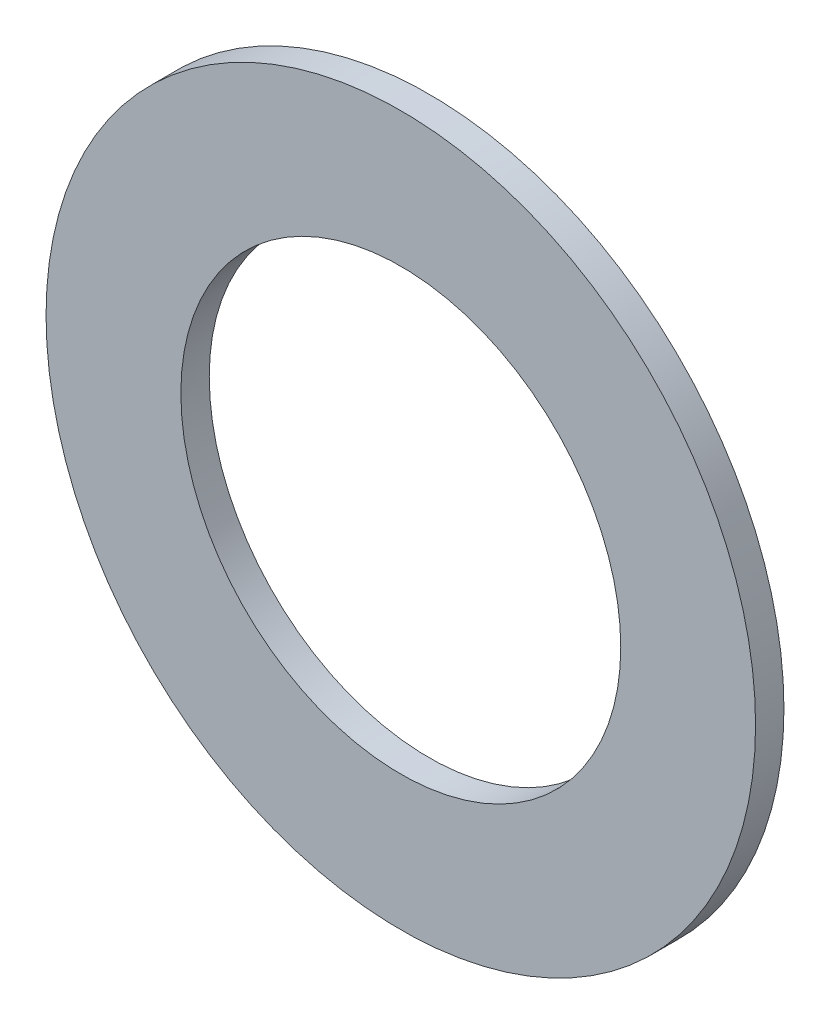
ISO-10303-21;
HEADER;
FILE_DESCRIPTION(('STEP AP214'),'2;1');
FILE_NAME('part.step','',(''),(''),'','','');
FILE_SCHEMA(('AUTOMOTIVE_DESIGN { 1 0 10303 214 1 1 1 1 }'));
ENDSEC;
DATA;
#1=APPLICATION_CONTEXT('core data for automotive mechanical design processes');
#2=APPLICATION_PROTOCOL_DEFINITION('international standard','automotive_design',2000,#1);
#3=PRODUCT_CONTEXT('',#1,'mechanical');
#4=PRODUCT('Part','Part','',(#3));
#5=PRODUCT_RELATED_PRODUCT_CATEGORY('part','',(#4));
#6=PRODUCT_DEFINITION_FORMATION('','',#4);
#7=PRODUCT_DEFINITION_CONTEXT('part definition',#1,'design');
#8=PRODUCT_DEFINITION('design','',#6,#7);
#9=PRODUCT_DEFINITION_SHAPE('','',#8);
#10=(LENGTH_UNIT() NAMED_UNIT(*) SI_UNIT(.MILLI.,.METRE.));
#11=(NAMED_UNIT(*) PLANE_ANGLE_UNIT() SI_UNIT($,.RADIAN.));
#12=(NAMED_UNIT(*) SI_UNIT($,.STERADIAN.) SOLID_ANGLE_UNIT());
#13=UNCERTAINTY_MEASURE_WITH_UNIT(LENGTH_MEASURE(1.E-05),#10,'distance_accuracy_value','');
#14=(GEOMETRIC_REPRESENTATION_CONTEXT(3) GLOBAL_UNCERTAINTY_ASSIGNED_CONTEXT((#13)) GLOBAL_UNIT_ASSIGNED_CONTEXT((#10,
#11,#12)) REPRESENTATION_CONTEXT('',''));
#15=CARTESIAN_POINT('',(0.,0.,0.));
#16=DIRECTION('',(0.,0.,1.));
#17=DIRECTION('',(1.,0.,0.));
#18=AXIS2_PLACEMENT_3D('',#15,#16,#17);
#19=CARTESIAN_POINT('',(0.,0.,0.));
#20=DIRECTION('',(0.,0.,1.));
#21=DIRECTION('',(1.,0.,0.));
#22=AXIS2_PLACEMENT_3D('',#19,#20,#21);
#23=PLANE('',#22);
#24=CARTESIAN_POINT('',(0.,0.,0.));
#25=DIRECTION('',(0.,0.,1.));
#26=DIRECTION('',(1.,0.,0.));
#27=AXIS2_PLACEMENT_3D('',#24,#25,#26);
#28=CIRCLE('',#27,6.35);
#29=CARTESIAN_POINT('',(6.35,0.,0.));
#30=VERTEX_POINT('',#29);
#31=EDGE_CURVE('E27',#30,#30,#28,.F.);
#32=ORIENTED_EDGE('',*,*,#31,.F.);
#33=EDGE_LOOP('',(#32));
#34=FACE_BOUND('',#33,.T.);
#35=CARTESIAN_POINT('',(0.,0.,0.));
#36=DIRECTION('',(0.,0.,1.));
#37=DIRECTION('',(1.,0.,0.));
#38=AXIS2_PLACEMENT_3D('',#35,#36,#37);
#39=CIRCLE('',#38,3.937);
#40=CARTESIAN_POINT('',(3.937,0.,0.));
#41=VERTEX_POINT('',#40);
#42=EDGE_CURVE('E18',#41,#41,#39,.F.);
#43=ORIENTED_EDGE('',*,*,#42,.T.);
#44=EDGE_LOOP('',(#43));
#45=FACE_BOUND('',#44,.T.);
#46=ADVANCED_FACE('F15',(#34,#45),#23,.T.);
#47=CARTESIAN_POINT('',(0.,0.,-0.508));
#48=DIRECTION('',(0.,0.,1.));
#49=DIRECTION('',(1.,0.,0.));
#50=AXIS2_PLACEMENT_3D('',#47,#48,#49);
#51=CYLINDRICAL_SURFACE('',#50,3.937);
#52=CARTESIAN_POINT('',(0.,0.,-0.508));
#53=DIRECTION('',(0.,0.,1.));
#54=DIRECTION('',(1.,0.,0.));
#55=AXIS2_PLACEMENT_3D('',#52,#53,#54);
#56=CIRCLE('',#55,3.937);
#57=CARTESIAN_POINT('',(3.937,0.,-0.508));
#58=VERTEX_POINT('',#57);
#59=EDGE_CURVE('E22',#58,#58,#56,.F.);
#60=ORIENTED_EDGE('',*,*,#59,.T.);
#61=EDGE_LOOP('',(#60));
#62=FACE_BOUND('',#61,.T.);
#63=ORIENTED_EDGE('',*,*,#42,.F.);
#64=EDGE_LOOP('',(#63));
#65=FACE_BOUND('',#64,.T.);
#66=ADVANCED_FACE('F36',(#62,#65),#51,.F.);
#67=CARTESIAN_POINT('',(0.,0.,-0.508));
#68=DIRECTION('',(0.,0.,1.));
#69=DIRECTION('',(1.,0.,0.));
#70=AXIS2_PLACEMENT_3D('',#67,#68,#69);
#71=CYLINDRICAL_SURFACE('',#70,6.35);
#72=ORIENTED_EDGE('',*,*,#31,.T.);
#73=EDGE_LOOP('',(#72));
#74=FACE_BOUND('',#73,.T.);
#75=CARTESIAN_POINT('',(0.,0.,-0.508));
#76=DIRECTION('',(0.,0.,1.));
#77=DIRECTION('',(1.,0.,0.));
#78=AXIS2_PLACEMENT_3D('',#75,#76,#77);
#79=CIRCLE('',#78,6.35);
#80=CARTESIAN_POINT('',(6.35,0.,-0.508));
#81=VERTEX_POINT('',#80);
#82=EDGE_CURVE('E9',#81,#81,#79,.T.);
#83=ORIENTED_EDGE('',*,*,#82,.T.);
#84=EDGE_LOOP('',(#83));
#85=FACE_BOUND('',#84,.T.);
#86=ADVANCED_FACE('F38',(#74,#85),#71,.T.);
#87=CARTESIAN_POINT('',(0.,0.,-0.508));
#88=DIRECTION('',(0.,0.,1.));
#89=DIRECTION('',(1.,0.,0.));
#90=AXIS2_PLACEMENT_3D('',#87,#88,#89);
#91=PLANE('',#90);
#92=ORIENTED_EDGE('',*,*,#82,.F.);
#93=EDGE_LOOP('',(#92));
#94=FACE_BOUND('',#93,.T.);
#95=ORIENTED_EDGE('',*,*,#59,.F.);
#96=EDGE_LOOP('',(#95));
#97=FACE_BOUND('',#96,.T.);
#98=ADVANCED_FACE('F45',(#94,#97),#91,.F.);
#99=CLOSED_SHELL('',(#46,#66,#86,#98));
#100=MANIFOLD_SOLID_BREP('B1',#99);
#101=ADVANCED_BREP_SHAPE_REPRESENTATION('',(#18,#100),#14);
#102=SHAPE_DEFINITION_REPRESENTATION(#9,#101);
ENDSEC;
END-ISO-10303-21;
